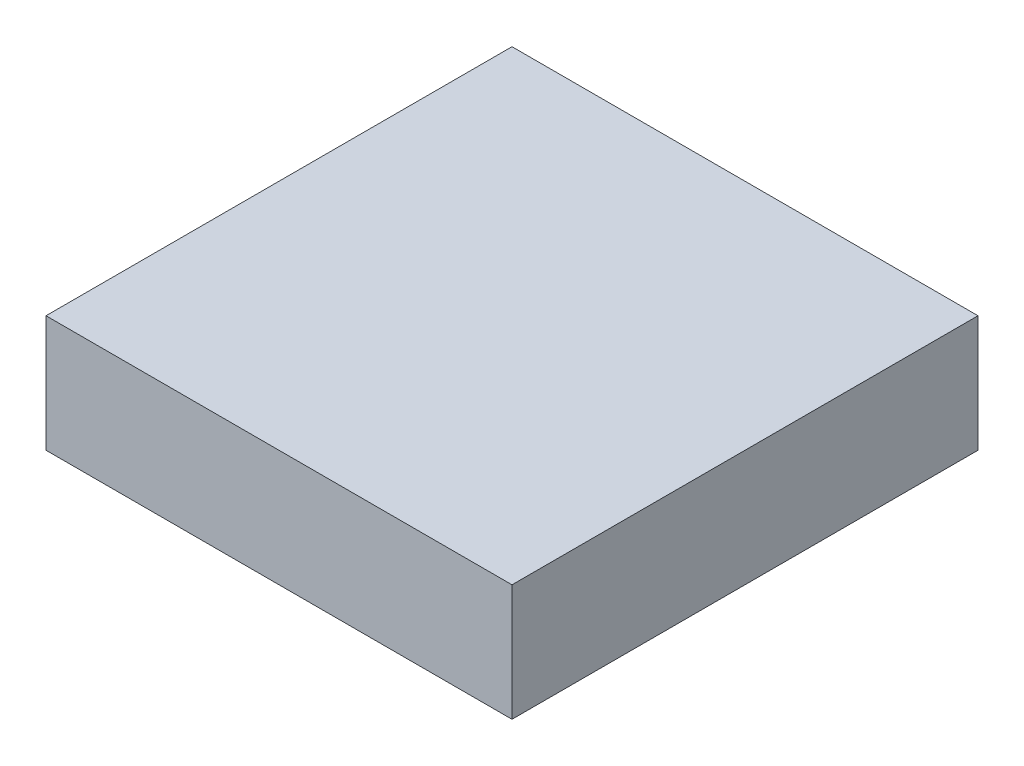
ISO-10303-21;
HEADER;
FILE_DESCRIPTION(('STEP AP214'),'2;1');
FILE_NAME('part.step','',(''),(''),'','','');
FILE_SCHEMA(('AUTOMOTIVE_DESIGN { 1 0 10303 214 1 1 1 1 }'));
ENDSEC;
DATA;
#1=APPLICATION_CONTEXT('core data for automotive mechanical design processes');
#2=APPLICATION_PROTOCOL_DEFINITION('international standard','automotive_design',2000,#1);
#3=PRODUCT_CONTEXT('',#1,'mechanical');
#4=PRODUCT('Part','Part','',(#3));
#5=PRODUCT_RELATED_PRODUCT_CATEGORY('part','',(#4));
#6=PRODUCT_DEFINITION_FORMATION('','',#4);
#7=PRODUCT_DEFINITION_CONTEXT('part definition',#1,'design');
#8=PRODUCT_DEFINITION('design','',#6,#7);
#9=PRODUCT_DEFINITION_SHAPE('','',#8);
#10=(LENGTH_UNIT() NAMED_UNIT(*) SI_UNIT(.MILLI.,.METRE.));
#11=(NAMED_UNIT(*) PLANE_ANGLE_UNIT() SI_UNIT($,.RADIAN.));
#12=(NAMED_UNIT(*) SI_UNIT($,.STERADIAN.) SOLID_ANGLE_UNIT());
#13=UNCERTAINTY_MEASURE_WITH_UNIT(LENGTH_MEASURE(1.E-05),#10,'distance_accuracy_value','');
#14=(GEOMETRIC_REPRESENTATION_CONTEXT(3) GLOBAL_UNCERTAINTY_ASSIGNED_CONTEXT((#13)) GLOBAL_UNIT_ASSIGNED_CONTEXT((#10,
#11,#12)) REPRESENTATION_CONTEXT('',''));
#15=CARTESIAN_POINT('',(0.,0.,0.));
#16=DIRECTION('',(0.,0.,1.));
#17=DIRECTION('',(1.,0.,0.));
#18=AXIS2_PLACEMENT_3D('',#15,#16,#17);
#19=CARTESIAN_POINT('',(-3.04093241233324,1.,-1.82975839103348));
#20=DIRECTION('',(1.,0.,0.));
#21=DIRECTION('',(0.,0.,-1.));
#22=AXIS2_PLACEMENT_3D('',#19,#20,#21);
#23=PLANE('',#22);
#24=DIRECTION('',(0.,0.,1.));
#25=VECTOR('',#24,1.);
#26=CARTESIAN_POINT('',(-3.04093241233324,0.,-1.82975839103348));
#27=LINE('',#26,#25);
#28=CARTESIAN_POINT('',(-3.04093241233324,0.,-1.82975839103348));
#29=VERTEX_POINT('',#28);
#30=CARTESIAN_POINT('',(-3.04093241233324,0.,2.17024160896652));
#31=VERTEX_POINT('',#30);
#32=EDGE_CURVE('E97',#29,#31,#27,.T.);
#33=ORIENTED_EDGE('',*,*,#32,.T.);
#34=DIRECTION('',(0.,-1.,0.));
#35=VECTOR('',#34,1.);
#36=CARTESIAN_POINT('',(-3.04093241233324,1.,2.17024160896652));
#37=LINE('',#36,#35);
#38=CARTESIAN_POINT('',(-3.04093241233324,1.,2.17024160896652));
#39=VERTEX_POINT('',#38);
#40=EDGE_CURVE('E11',#39,#31,#37,.T.);
#41=ORIENTED_EDGE('',*,*,#40,.F.);
#42=DIRECTION('',(0.,0.,1.));
#43=VECTOR('',#42,1.);
#44=CARTESIAN_POINT('',(-3.04093241233324,1.,-1.82975839103348));
#45=LINE('',#44,#43);
#46=CARTESIAN_POINT('',(-3.04093241233324,1.,-1.82975839103348));
#47=VERTEX_POINT('',#46);
#48=EDGE_CURVE('E85',#47,#39,#45,.T.);
#49=ORIENTED_EDGE('',*,*,#48,.F.);
#50=DIRECTION('',(0.,-1.,0.));
#51=VECTOR('',#50,1.);
#52=CARTESIAN_POINT('',(-3.04093241233324,1.,-1.82975839103348));
#53=LINE('',#52,#51);
#54=EDGE_CURVE('E93',#47,#29,#53,.T.);
#55=ORIENTED_EDGE('',*,*,#54,.T.);
#56=EDGE_LOOP('',(#33,#41,#49,#55));
#57=FACE_BOUND('',#56,.T.);
#58=ADVANCED_FACE('F34',(#57),#23,.F.);
#59=CARTESIAN_POINT('',(-3.04093241233324,1.,2.17024160896652));
#60=DIRECTION('',(0.,0.,-1.));
#61=DIRECTION('',(-1.,0.,0.));
#62=AXIS2_PLACEMENT_3D('',#59,#60,#61);
#63=PLANE('',#62);
#64=DIRECTION('',(1.,0.,0.));
#65=VECTOR('',#64,1.);
#66=CARTESIAN_POINT('',(-3.04093241233324,0.,2.17024160896652));
#67=LINE('',#66,#65);
#68=CARTESIAN_POINT('',(0.959067587666764,0.,2.17024160896652));
#69=VERTEX_POINT('',#68);
#70=EDGE_CURVE('E89',#31,#69,#67,.T.);
#71=ORIENTED_EDGE('',*,*,#70,.T.);
#72=DIRECTION('',(0.,-1.,0.));
#73=VECTOR('',#72,1.);
#74=CARTESIAN_POINT('',(0.959067587666764,1.,2.17024160896652));
#75=LINE('',#74,#73);
#76=CARTESIAN_POINT('',(0.959067587666764,1.,2.17024160896652));
#77=VERTEX_POINT('',#76);
#78=EDGE_CURVE('E42',#77,#69,#75,.T.);
#79=ORIENTED_EDGE('',*,*,#78,.F.);
#80=DIRECTION('',(1.,0.,0.));
#81=VECTOR('',#80,1.);
#82=CARTESIAN_POINT('',(-3.04093241233324,1.,2.17024160896652));
#83=LINE('',#82,#81);
#84=EDGE_CURVE('E80',#39,#77,#83,.T.);
#85=ORIENTED_EDGE('',*,*,#84,.F.);
#86=ORIENTED_EDGE('',*,*,#40,.T.);
#87=EDGE_LOOP('',(#71,#79,#85,#86));
#88=FACE_BOUND('',#87,.T.);
#89=ADVANCED_FACE('F88',(#88),#63,.F.);
#90=CARTESIAN_POINT('',(0.959067587666763,1.,-1.82975839103348));
#91=DIRECTION('',(-1.,0.,0.));
#92=DIRECTION('',(0.,0.,1.));
#93=AXIS2_PLACEMENT_3D('',#90,#91,#92);
#94=PLANE('',#93);
#95=DIRECTION('',(0.,0.,-1.));
#96=VECTOR('',#95,1.);
#97=CARTESIAN_POINT('',(0.959067587666763,0.,-1.82975839103348));
#98=LINE('',#97,#96);
#99=CARTESIAN_POINT('',(0.959067587666763,0.,-1.82975839103348));
#100=VERTEX_POINT('',#99);
#101=EDGE_CURVE('E67',#69,#100,#98,.T.);
#102=ORIENTED_EDGE('',*,*,#101,.T.);
#103=DIRECTION('',(0.,-1.,0.));
#104=VECTOR('',#103,1.);
#105=CARTESIAN_POINT('',(0.959067587666763,1.,-1.82975839103348));
#106=LINE('',#105,#104);
#107=CARTESIAN_POINT('',(0.959067587666763,1.,-1.82975839103348));
#108=VERTEX_POINT('',#107);
#109=EDGE_CURVE('E90',#108,#100,#106,.T.);
#110=ORIENTED_EDGE('',*,*,#109,.F.);
#111=DIRECTION('',(0.,0.,-1.));
#112=VECTOR('',#111,1.);
#113=CARTESIAN_POINT('',(0.959067587666763,1.,-1.82975839103348));
#114=LINE('',#113,#112);
#115=EDGE_CURVE('E83',#77,#108,#114,.T.);
#116=ORIENTED_EDGE('',*,*,#115,.F.);
#117=ORIENTED_EDGE('',*,*,#78,.T.);
#118=EDGE_LOOP('',(#102,#110,#116,#117));
#119=FACE_BOUND('',#118,.T.);
#120=ADVANCED_FACE('F91',(#119),#94,.F.);
#121=CARTESIAN_POINT('',(-3.04093241233324,1.,-1.82975839103348));
#122=DIRECTION('',(0.,0.,1.));
#123=DIRECTION('',(1.,0.,0.));
#124=AXIS2_PLACEMENT_3D('',#121,#122,#123);
#125=PLANE('',#124);
#126=DIRECTION('',(-1.,0.,0.));
#127=VECTOR('',#126,1.);
#128=CARTESIAN_POINT('',(-3.04093241233324,0.,-1.82975839103348));
#129=LINE('',#128,#127);
#130=EDGE_CURVE('E73',#100,#29,#129,.T.);
#131=ORIENTED_EDGE('',*,*,#130,.T.);
#132=ORIENTED_EDGE('',*,*,#54,.F.);
#133=DIRECTION('',(-1.,0.,0.));
#134=VECTOR('',#133,1.);
#135=CARTESIAN_POINT('',(-3.04093241233324,1.,-1.82975839103348));
#136=LINE('',#135,#134);
#137=EDGE_CURVE('E50',#108,#47,#136,.T.);
#138=ORIENTED_EDGE('',*,*,#137,.F.);
#139=ORIENTED_EDGE('',*,*,#109,.T.);
#140=EDGE_LOOP('',(#131,#132,#138,#139));
#141=FACE_BOUND('',#140,.T.);
#142=ADVANCED_FACE('F104',(#141),#125,.F.);
#143=CARTESIAN_POINT('',(0.,1.,0.));
#144=DIRECTION('',(0.,1.,0.));
#145=DIRECTION('',(0.,0.,1.));
#146=AXIS2_PLACEMENT_3D('',#143,#144,#145);
#147=PLANE('',#146);
#148=ORIENTED_EDGE('',*,*,#48,.T.);
#149=ORIENTED_EDGE('',*,*,#84,.T.);
#150=ORIENTED_EDGE('',*,*,#115,.T.);
#151=ORIENTED_EDGE('',*,*,#137,.T.);
#152=EDGE_LOOP('',(#148,#149,#150,#151));
#153=FACE_BOUND('',#152,.T.);
#154=ADVANCED_FACE('F81',(#153),#147,.T.);
#155=CARTESIAN_POINT('',(0.,0.,0.));
#156=DIRECTION('',(0.,1.,0.));
#157=DIRECTION('',(0.,0.,1.));
#158=AXIS2_PLACEMENT_3D('',#155,#156,#157);
#159=PLANE('',#158);
#160=ORIENTED_EDGE('',*,*,#32,.F.);
#161=ORIENTED_EDGE('',*,*,#130,.F.);
#162=ORIENTED_EDGE('',*,*,#101,.F.);
#163=ORIENTED_EDGE('',*,*,#70,.F.);
#164=EDGE_LOOP('',(#160,#161,#162,#163));
#165=FACE_BOUND('',#164,.T.);
#166=ADVANCED_FACE('F107',(#165),#159,.F.);
#167=CLOSED_SHELL('',(#58,#89,#120,#142,#154,#166));
#168=MANIFOLD_SOLID_BREP('B2',#167);
#169=ADVANCED_BREP_SHAPE_REPRESENTATION('',(#18,#168),#14);
#170=SHAPE_DEFINITION_REPRESENTATION(#9,#169);
ENDSEC;
END-ISO-10303-21;
